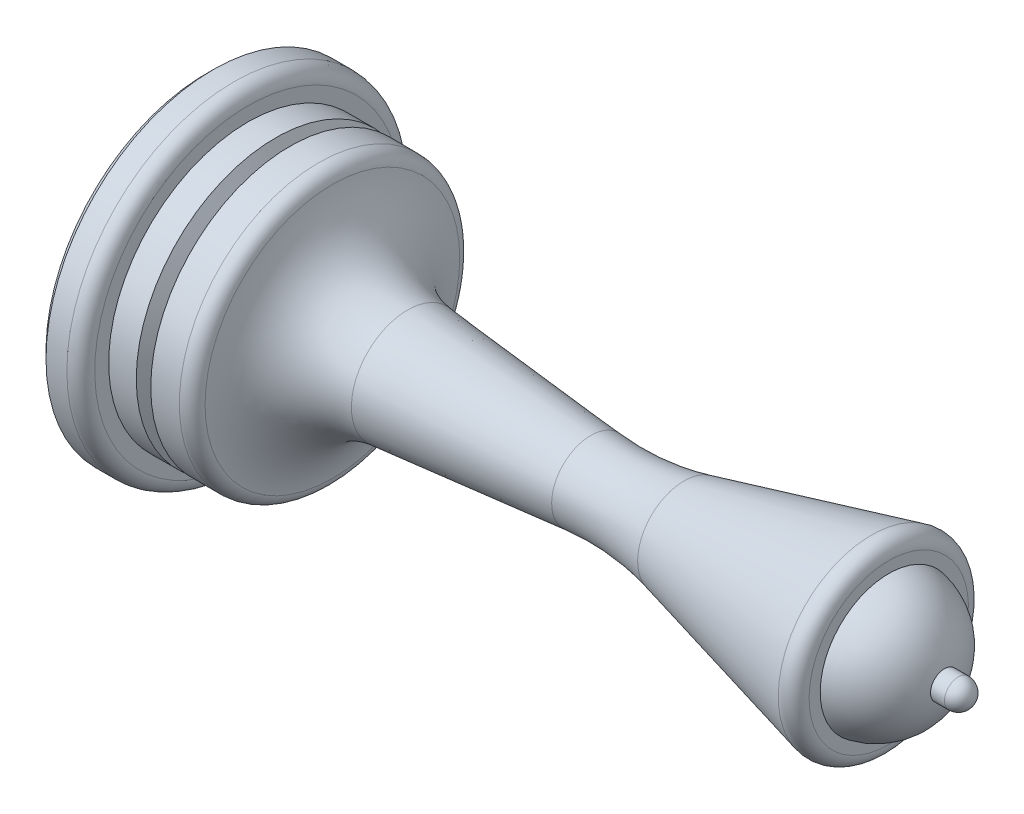
ISO-10303-21;
HEADER;
FILE_DESCRIPTION(('STEP AP214'),'2;1');
FILE_NAME('part.step','',(''),(''),'','','');
FILE_SCHEMA(('AUTOMOTIVE_DESIGN { 1 0 10303 214 1 1 1 1 }'));
ENDSEC;
DATA;
#1=APPLICATION_CONTEXT('core data for automotive mechanical design processes');
#2=APPLICATION_PROTOCOL_DEFINITION('international standard','automotive_design',2000,#1);
#3=PRODUCT_CONTEXT('',#1,'mechanical');
#4=PRODUCT('Part','Part','',(#3));
#5=PRODUCT_RELATED_PRODUCT_CATEGORY('part','',(#4));
#6=PRODUCT_DEFINITION_FORMATION('','',#4);
#7=PRODUCT_DEFINITION_CONTEXT('part definition',#1,'design');
#8=PRODUCT_DEFINITION('design','',#6,#7);
#9=PRODUCT_DEFINITION_SHAPE('','',#8);
#10=(LENGTH_UNIT() NAMED_UNIT(*) SI_UNIT(.MILLI.,.METRE.));
#11=(NAMED_UNIT(*) PLANE_ANGLE_UNIT() SI_UNIT($,.RADIAN.));
#12=(NAMED_UNIT(*) SI_UNIT($,.STERADIAN.) SOLID_ANGLE_UNIT());
#13=UNCERTAINTY_MEASURE_WITH_UNIT(LENGTH_MEASURE(1.E-05),#10,'distance_accuracy_value','');
#14=(GEOMETRIC_REPRESENTATION_CONTEXT(3) GLOBAL_UNCERTAINTY_ASSIGNED_CONTEXT((#13)) GLOBAL_UNIT_ASSIGNED_CONTEXT((#10,
#11,#12)) REPRESENTATION_CONTEXT('',''));
#15=CARTESIAN_POINT('',(0.,0.,0.));
#16=DIRECTION('',(0.,0.,1.));
#17=DIRECTION('',(1.,0.,0.));
#18=AXIS2_PLACEMENT_3D('',#15,#16,#17);
#19=CARTESIAN_POINT('',(0.,0.,0.));
#20=DIRECTION('',(-1.,0.,0.));
#21=DIRECTION('',(0.,-1.,0.));
#22=AXIS2_PLACEMENT_3D('',#19,#20,#21);
#23=CYLINDRICAL_SURFACE('',#22,10.);
#24=CARTESIAN_POINT('',(8.07179676972449,0.,0.));
#25=DIRECTION('',(-1.,0.,0.));
#26=DIRECTION('',(0.,-1.,0.));
#27=AXIS2_PLACEMENT_3D('',#24,#25,#26);
#28=CIRCLE('',#27,10.);
#29=CARTESIAN_POINT('',(8.07179676972449,-10.,0.));
#30=VERTEX_POINT('',#29);
#31=EDGE_CURVE('E65',#30,#30,#28,.T.);
#32=ORIENTED_EDGE('',*,*,#31,.T.);
#33=EDGE_LOOP('',(#32));
#34=FACE_BOUND('',#33,.T.);
#35=CARTESIAN_POINT('',(6.02056705055174,0.,0.));
#36=DIRECTION('',(-1.,0.,0.));
#37=DIRECTION('',(0.,0.,1.));
#38=AXIS2_PLACEMENT_3D('',#35,#36,#37);
#39=CIRCLE('',#38,10.);
#40=CARTESIAN_POINT('',(6.02056705055174,0.,10.));
#41=VERTEX_POINT('',#40);
#42=EDGE_CURVE('E89',#41,#41,#39,.T.);
#43=ORIENTED_EDGE('',*,*,#42,.F.);
#44=EDGE_LOOP('',(#43));
#45=FACE_BOUND('',#44,.T.);
#46=ADVANCED_FACE('F30',(#34,#45),#23,.T.);
#47=CARTESIAN_POINT('',(54.,0.,0.));
#48=DIRECTION('',(-1.,0.,0.));
#49=DIRECTION('',(0.,1.,0.));
#50=AXIS2_PLACEMENT_3D('',#47,#48,#49);
#51=SPHERICAL_SURFACE('',#50,1.);
#52=CARTESIAN_POINT('',(54.,0.,0.));
#53=DIRECTION('',(-1.,0.,0.));
#54=DIRECTION('',(0.,-1.,0.));
#55=AXIS2_PLACEMENT_3D('',#52,#53,#54);
#56=CIRCLE('',#55,1.);
#57=CARTESIAN_POINT('',(54.,-1.,0.));
#58=VERTEX_POINT('',#57);
#59=EDGE_CURVE('E41',#58,#58,#56,.T.);
#60=ORIENTED_EDGE('',*,*,#59,.F.);
#61=EDGE_LOOP('',(#60));
#62=FACE_BOUND('',#61,.T.);
#63=ADVANCED_FACE('F159',(#62),#51,.T.);
#64=CARTESIAN_POINT('',(0.,0.,0.));
#65=DIRECTION('',(-1.,0.,0.));
#66=DIRECTION('',(0.,-1.,0.));
#67=AXIS2_PLACEMENT_3D('',#64,#65,#66);
#68=CYLINDRICAL_SURFACE('',#67,1.);
#69=CARTESIAN_POINT('',(53.,0.,0.));
#70=DIRECTION('',(-1.,0.,0.));
#71=DIRECTION('',(0.,-1.,0.));
#72=AXIS2_PLACEMENT_3D('',#69,#70,#71);
#73=CIRCLE('',#72,1.);
#74=CARTESIAN_POINT('',(53.,-1.,0.));
#75=VERTEX_POINT('',#74);
#76=EDGE_CURVE('E45',#75,#75,#73,.T.);
#77=ORIENTED_EDGE('',*,*,#76,.F.);
#78=EDGE_LOOP('',(#77));
#79=FACE_BOUND('',#78,.T.);
#80=ORIENTED_EDGE('',*,*,#59,.T.);
#81=EDGE_LOOP('',(#80));
#82=FACE_BOUND('',#81,.T.);
#83=ADVANCED_FACE('F164',(#79,#82),#68,.T.);
#84=CARTESIAN_POINT('',(48.1010205144336,0.,0.));
#85=DIRECTION('',(-1.,0.,0.));
#86=DIRECTION('',(0.,1.,0.));
#87=AXIS2_PLACEMENT_3D('',#84,#85,#86);
#88=SPHERICAL_SURFACE('',#87,5.);
#89=CARTESIAN_POINT('',(49.,0.,0.));
#90=DIRECTION('',(-1.,0.,0.));
#91=DIRECTION('',(0.,-1.,0.));
#92=AXIS2_PLACEMENT_3D('',#89,#90,#91);
#93=CIRCLE('',#92,4.91851968426791);
#94=CARTESIAN_POINT('',(49.,-4.91851968426791,0.));
#95=VERTEX_POINT('',#94);
#96=EDGE_CURVE('E50',#95,#95,#93,.T.);
#97=ORIENTED_EDGE('',*,*,#96,.F.);
#98=EDGE_LOOP('',(#97));
#99=FACE_BOUND('',#98,.T.);
#100=ORIENTED_EDGE('',*,*,#76,.T.);
#101=EDGE_LOOP('',(#100));
#102=FACE_BOUND('',#101,.T.);
#103=ADVANCED_FACE('F185',(#99,#102),#88,.T.);
#104=CARTESIAN_POINT('',(49.,7.,0.));
#105=DIRECTION('',(-1.,0.,0.));
#106=DIRECTION('',(0.,-1.,0.));
#107=AXIS2_PLACEMENT_3D('',#104,#105,#106);
#108=PLANE('',#107);
#109=CARTESIAN_POINT('',(49.,0.,0.));
#110=DIRECTION('',(-1.,0.,0.));
#111=DIRECTION('',(0.,-1.,0.));
#112=AXIS2_PLACEMENT_3D('',#109,#110,#111);
#113=CIRCLE('',#112,5.71922359359559);
#114=CARTESIAN_POINT('',(49.,-5.71922359359559,0.));
#115=VERTEX_POINT('',#114);
#116=EDGE_CURVE('E10',#115,#115,#113,.F.);
#117=ORIENTED_EDGE('',*,*,#116,.T.);
#118=EDGE_LOOP('',(#117));
#119=FACE_BOUND('',#118,.T.);
#120=ORIENTED_EDGE('',*,*,#96,.T.);
#121=EDGE_LOOP('',(#120));
#122=FACE_BOUND('',#121,.T.);
#123=ADVANCED_FACE('F182',(#119,#122),#108,.F.);
#124=CARTESIAN_POINT('',(49.,0.,0.));
#125=DIRECTION('',(1.,0.,0.));
#126=DIRECTION('',(0.,1.,0.));
#127=AXIS2_PLACEMENT_3D('',#124,#125,#126);
#128=CONICAL_SURFACE('',#127,7.,0.244978663126864);
#129=CARTESIAN_POINT('',(47.7574643749637,0.,0.));
#130=DIRECTION('',(-1.,0.,0.));
#131=DIRECTION('',(0.,-1.,0.));
#132=AXIS2_PLACEMENT_3D('',#129,#130,#131);
#133=CIRCLE('',#132,6.68936609374092);
#134=CARTESIAN_POINT('',(47.7574643749637,-6.68936609374092,0.));
#135=VERTEX_POINT('',#134);
#136=EDGE_CURVE('E37',#135,#135,#133,.T.);
#137=ORIENTED_EDGE('',*,*,#136,.T.);
#138=EDGE_LOOP('',(#137));
#139=FACE_BOUND('',#138,.T.);
#140=CARTESIAN_POINT('',(34.2994782841861,0.,0.));
#141=DIRECTION('',(-1.,0.,0.));
#142=DIRECTION('',(0.,-1.,0.));
#143=AXIS2_PLACEMENT_3D('',#140,#141,#142);
#144=CIRCLE('',#143,3.32486957104653);
#145=CARTESIAN_POINT('',(34.2994782841861,-3.32486957104653,0.));
#146=VERTEX_POINT('',#145);
#147=EDGE_CURVE('E53',#146,#146,#144,.T.);
#148=ORIENTED_EDGE('',*,*,#147,.F.);
#149=EDGE_LOOP('',(#148));
#150=FACE_BOUND('',#149,.T.);
#151=ADVANCED_FACE('F178',(#139,#150),#128,.T.);
#152=CARTESIAN_POINT('',(29.4487657834594,0.,0.));
#153=DIRECTION('',(-1.,0.,0.));
#154=DIRECTION('',(0.,-1.,0.));
#155=AXIS2_PLACEMENT_3D('',#152,#153,#154);
#156=TOROIDAL_SURFACE('',#155,22.7277195739532,20.);
#157=CARTESIAN_POINT('',(27.6133277665205,0.,0.));
#158=DIRECTION('',(-1.,0.,0.));
#159=DIRECTION('',(0.,-1.,0.));
#160=AXIS2_PLACEMENT_3D('',#157,#158,#159);
#161=CIRCLE('',#160,2.81211847115);
#162=CARTESIAN_POINT('',(27.6133277665205,-2.81211847115,0.));
#163=VERTEX_POINT('',#162);
#164=EDGE_CURVE('E56',#163,#163,#161,.T.);
#165=ORIENTED_EDGE('',*,*,#164,.F.);
#166=EDGE_LOOP('',(#165));
#167=FACE_BOUND('',#166,.T.);
#168=ORIENTED_EDGE('',*,*,#147,.T.);
#169=EDGE_LOOP('',(#168));
#170=FACE_BOUND('',#169,.T.);
#171=ADVANCED_FACE('F174',(#167,#170),#156,.F.);
#172=CARTESIAN_POINT('',(27.6133277665205,0.,0.));
#173=DIRECTION('',(-1.,0.,0.));
#174=DIRECTION('',(0.,-1.,0.));
#175=AXIS2_PLACEMENT_3D('',#172,#173,#174);
#176=CONICAL_SURFACE('',#175,2.81211847115,0.0919012099312634);
#177=CARTESIAN_POINT('',(14.4493685949183,0.,0.));
#178=DIRECTION('',(-1.,0.,0.));
#179=DIRECTION('',(0.,-1.,0.));
#180=AXIS2_PLACEMENT_3D('',#177,#178,#179);
#181=CIRCLE('',#180,4.02531966915905);
#182=CARTESIAN_POINT('',(14.4493685949183,-4.02531966915905,0.));
#183=VERTEX_POINT('',#182);
#184=EDGE_CURVE('E59',#183,#183,#181,.T.);
#185=ORIENTED_EDGE('',*,*,#184,.F.);
#186=EDGE_LOOP('',(#185));
#187=FACE_BOUND('',#186,.T.);
#188=ORIENTED_EDGE('',*,*,#164,.T.);
#189=EDGE_LOOP('',(#188));
#190=FACE_BOUND('',#189,.T.);
#191=ADVANCED_FACE('F170',(#187,#190),#176,.T.);
#192=CARTESIAN_POINT('',(15.,0.,0.));
#193=DIRECTION('',(-1.,0.,0.));
#194=DIRECTION('',(0.,-1.,0.));
#195=AXIS2_PLACEMENT_3D('',#192,#193,#194);
#196=TOROIDAL_SURFACE('',#195,10.,6.);
#197=CARTESIAN_POINT('',(9.06154008833528,0.,0.));
#198=DIRECTION('',(-1.,0.,0.));
#199=DIRECTION('',(0.,-1.,0.));
#200=AXIS2_PLACEMENT_3D('',#197,#198,#199);
#201=CIRCLE('',#200,9.14285714285714);
#202=CARTESIAN_POINT('',(9.06154008833528,-9.14285714285714,0.));
#203=VERTEX_POINT('',#202);
#204=EDGE_CURVE('E62',#203,#203,#201,.T.);
#205=ORIENTED_EDGE('',*,*,#204,.F.);
#206=EDGE_LOOP('',(#205));
#207=FACE_BOUND('',#206,.T.);
#208=ORIENTED_EDGE('',*,*,#184,.T.);
#209=EDGE_LOOP('',(#208));
#210=FACE_BOUND('',#209,.T.);
#211=ADVANCED_FACE('F155',(#207,#210),#196,.F.);
#212=CARTESIAN_POINT('',(8.07179676972449,0.,0.));
#213=DIRECTION('',(-1.,0.,0.));
#214=DIRECTION('',(0.,-1.,0.));
#215=AXIS2_PLACEMENT_3D('',#212,#213,#214);
#216=TOROIDAL_SURFACE('',#215,9.,1.);
#217=ORIENTED_EDGE('',*,*,#31,.F.);
#218=EDGE_LOOP('',(#217));
#219=FACE_BOUND('',#218,.T.);
#220=ORIENTED_EDGE('',*,*,#204,.T.);
#221=EDGE_LOOP('',(#220));
#222=FACE_BOUND('',#221,.T.);
#223=ADVANCED_FACE('F146',(#219,#222),#216,.T.);
#224=CARTESIAN_POINT('',(4.97943294944826,0.,0.));
#225=DIRECTION('',(-1.,0.,0.));
#226=DIRECTION('',(0.,0.,1.));
#227=AXIS2_PLACEMENT_3D('',#224,#225,#226);
#228=CONICAL_SURFACE('',#227,10.,1.09083078249646);
#229=CARTESIAN_POINT('',(5.5,0.,0.));
#230=DIRECTION('',(-1.,0.,0.));
#231=DIRECTION('',(0.,0.,1.));
#232=AXIS2_PLACEMENT_3D('',#229,#230,#231);
#233=CIRCLE('',#232,9.);
#234=CARTESIAN_POINT('',(5.5,0.,9.));
#235=VERTEX_POINT('',#234);
#236=EDGE_CURVE('E86',#235,#235,#233,.T.);
#237=ORIENTED_EDGE('',*,*,#236,.T.);
#238=EDGE_LOOP('',(#237));
#239=FACE_BOUND('',#238,.T.);
#240=CARTESIAN_POINT('',(4.97943294944826,0.,0.));
#241=DIRECTION('',(-1.,0.,0.));
#242=DIRECTION('',(0.,0.,1.));
#243=AXIS2_PLACEMENT_3D('',#240,#241,#242);
#244=CIRCLE('',#243,10.);
#245=CARTESIAN_POINT('',(4.97943294944826,0.,10.));
#246=VERTEX_POINT('',#245);
#247=EDGE_CURVE('E83',#246,#246,#244,.T.);
#248=ORIENTED_EDGE('',*,*,#247,.F.);
#249=EDGE_LOOP('',(#248));
#250=FACE_BOUND('',#249,.T.);
#251=ADVANCED_FACE('F144',(#239,#250),#228,.T.);
#252=CARTESIAN_POINT('',(5.5,0.,0.));
#253=DIRECTION('',(1.,0.,0.));
#254=DIRECTION('',(0.,0.,-1.));
#255=AXIS2_PLACEMENT_3D('',#252,#253,#254);
#256=CONICAL_SURFACE('',#255,9.,1.09083078249646);
#257=ORIENTED_EDGE('',*,*,#42,.T.);
#258=EDGE_LOOP('',(#257));
#259=FACE_BOUND('',#258,.T.);
#260=ORIENTED_EDGE('',*,*,#236,.F.);
#261=EDGE_LOOP('',(#260));
#262=FACE_BOUND('',#261,.T.);
#263=ADVANCED_FACE('F112',(#259,#262),#256,.T.);
#264=CARTESIAN_POINT('',(0.,0.,0.));
#265=DIRECTION('',(1.,0.,0.));
#266=DIRECTION('',(0.,1.,0.));
#267=AXIS2_PLACEMENT_3D('',#264,#265,#266);
#268=PLANE('',#267);
#269=CARTESIAN_POINT('',(0.,0.,0.));
#270=DIRECTION('',(-1.,0.,0.));
#271=DIRECTION('',(0.,-1.,0.));
#272=AXIS2_PLACEMENT_3D('',#269,#270,#271);
#273=CIRCLE('',#272,6.);
#274=CARTESIAN_POINT('',(0.,-6.,0.));
#275=VERTEX_POINT('',#274);
#276=EDGE_CURVE('E93',#275,#275,#273,.T.);
#277=ORIENTED_EDGE('',*,*,#276,.F.);
#278=EDGE_LOOP('',(#277));
#279=FACE_BOUND('',#278,.T.);
#280=CARTESIAN_POINT('',(0.,0.,0.));
#281=DIRECTION('',(-1.,0.,0.));
#282=DIRECTION('',(0.,-1.,0.));
#283=AXIS2_PLACEMENT_3D('',#280,#281,#282);
#284=CIRCLE('',#283,11.5);
#285=CARTESIAN_POINT('',(0.,-11.5,0.));
#286=VERTEX_POINT('',#285);
#287=EDGE_CURVE('E80',#286,#286,#284,.T.);
#288=ORIENTED_EDGE('',*,*,#287,.T.);
#289=EDGE_LOOP('',(#288));
#290=FACE_BOUND('',#289,.T.);
#291=ADVANCED_FACE('F108',(#279,#290),#268,.F.);
#292=CARTESIAN_POINT('',(0.5,0.,0.));
#293=DIRECTION('',(1.,0.,0.));
#294=DIRECTION('',(0.,1.,0.));
#295=AXIS2_PLACEMENT_3D('',#292,#293,#294);
#296=CONICAL_SURFACE('',#295,12.,0.785398163397449);
#297=ORIENTED_EDGE('',*,*,#287,.F.);
#298=EDGE_LOOP('',(#297));
#299=FACE_BOUND('',#298,.T.);
#300=CARTESIAN_POINT('',(0.5,0.,0.));
#301=DIRECTION('',(-1.,0.,0.));
#302=DIRECTION('',(0.,-1.,0.));
#303=AXIS2_PLACEMENT_3D('',#300,#301,#302);
#304=CIRCLE('',#303,12.);
#305=CARTESIAN_POINT('',(0.5,-12.,0.));
#306=VERTEX_POINT('',#305);
#307=EDGE_CURVE('E77',#306,#306,#304,.T.);
#308=ORIENTED_EDGE('',*,*,#307,.T.);
#309=EDGE_LOOP('',(#308));
#310=FACE_BOUND('',#309,.T.);
#311=ADVANCED_FACE('F111',(#299,#310),#296,.T.);
#312=CARTESIAN_POINT('',(0.,0.,0.));
#313=DIRECTION('',(-1.,0.,0.));
#314=DIRECTION('',(0.,-1.,0.));
#315=AXIS2_PLACEMENT_3D('',#312,#313,#314);
#316=CYLINDRICAL_SURFACE('',#315,12.);
#317=ORIENTED_EDGE('',*,*,#307,.F.);
#318=EDGE_LOOP('',(#317));
#319=FACE_BOUND('',#318,.T.);
#320=CARTESIAN_POINT('',(2.,0.,0.));
#321=DIRECTION('',(-1.,0.,0.));
#322=DIRECTION('',(0.,-1.,0.));
#323=AXIS2_PLACEMENT_3D('',#320,#321,#322);
#324=CIRCLE('',#323,12.);
#325=CARTESIAN_POINT('',(2.,-12.,0.));
#326=VERTEX_POINT('',#325);
#327=EDGE_CURVE('E74',#326,#326,#324,.T.);
#328=ORIENTED_EDGE('',*,*,#327,.T.);
#329=EDGE_LOOP('',(#328));
#330=FACE_BOUND('',#329,.T.);
#331=ADVANCED_FACE('F118',(#319,#330),#316,.T.);
#332=CARTESIAN_POINT('',(2.,0.,0.));
#333=DIRECTION('',(-1.,0.,0.));
#334=DIRECTION('',(0.,-1.,0.));
#335=AXIS2_PLACEMENT_3D('',#332,#333,#334);
#336=TOROIDAL_SURFACE('',#335,11.,1.);
#337=ORIENTED_EDGE('',*,*,#327,.F.);
#338=EDGE_LOOP('',(#337));
#339=FACE_BOUND('',#338,.T.);
#340=CARTESIAN_POINT('',(3.,0.,0.));
#341=DIRECTION('',(-1.,0.,0.));
#342=DIRECTION('',(0.,-1.,0.));
#343=AXIS2_PLACEMENT_3D('',#340,#341,#342);
#344=CIRCLE('',#343,11.);
#345=CARTESIAN_POINT('',(3.,-11.,0.));
#346=VERTEX_POINT('',#345);
#347=EDGE_CURVE('E71',#346,#346,#344,.T.);
#348=ORIENTED_EDGE('',*,*,#347,.T.);
#349=EDGE_LOOP('',(#348));
#350=FACE_BOUND('',#349,.T.);
#351=ADVANCED_FACE('F124',(#339,#350),#336,.T.);
#352=CARTESIAN_POINT('',(3.,11.,0.));
#353=DIRECTION('',(-1.,0.,0.));
#354=DIRECTION('',(0.,-1.,0.));
#355=AXIS2_PLACEMENT_3D('',#352,#353,#354);
#356=PLANE('',#355);
#357=ORIENTED_EDGE('',*,*,#347,.F.);
#358=EDGE_LOOP('',(#357));
#359=FACE_BOUND('',#358,.T.);
#360=CARTESIAN_POINT('',(3.,0.,0.));
#361=DIRECTION('',(-1.,0.,0.));
#362=DIRECTION('',(0.,-1.,0.));
#363=AXIS2_PLACEMENT_3D('',#360,#361,#362);
#364=CIRCLE('',#363,10.);
#365=CARTESIAN_POINT('',(3.,-10.,0.));
#366=VERTEX_POINT('',#365);
#367=EDGE_CURVE('E68',#366,#366,#364,.T.);
#368=ORIENTED_EDGE('',*,*,#367,.T.);
#369=EDGE_LOOP('',(#368));
#370=FACE_BOUND('',#369,.T.);
#371=ADVANCED_FACE('F130',(#359,#370),#356,.F.);
#372=ORIENTED_EDGE('',*,*,#367,.F.);
#373=EDGE_LOOP('',(#372));
#374=FACE_BOUND('',#373,.T.);
#375=ORIENTED_EDGE('',*,*,#247,.T.);
#376=EDGE_LOOP('',(#375));
#377=FACE_BOUND('',#376,.T.);
#378=ADVANCED_FACE('F104',(#374,#377),#23,.T.);
#379=CARTESIAN_POINT('',(5.,0.,0.));
#380=DIRECTION('',(-1.,0.,0.));
#381=DIRECTION('',(0.,-1.,0.));
#382=AXIS2_PLACEMENT_3D('',#379,#380,#381);
#383=CYLINDRICAL_SURFACE('',#382,6.);
#384=CARTESIAN_POINT('',(5.,0.,0.));
#385=DIRECTION('',(-1.,0.,0.));
#386=DIRECTION('',(0.,-1.,0.));
#387=AXIS2_PLACEMENT_3D('',#384,#385,#386);
#388=CIRCLE('',#387,6.);
#389=CARTESIAN_POINT('',(5.,-6.,0.));
#390=VERTEX_POINT('',#389);
#391=EDGE_CURVE('E92',#390,#390,#388,.T.);
#392=ORIENTED_EDGE('',*,*,#391,.F.);
#393=EDGE_LOOP('',(#392));
#394=FACE_BOUND('',#393,.T.);
#395=ORIENTED_EDGE('',*,*,#276,.T.);
#396=EDGE_LOOP('',(#395));
#397=FACE_BOUND('',#396,.T.);
#398=ADVANCED_FACE('F101',(#394,#397),#383,.F.);
#399=CARTESIAN_POINT('',(5.,0.,0.));
#400=DIRECTION('',(-1.,0.,0.));
#401=DIRECTION('',(0.,-1.,0.));
#402=AXIS2_PLACEMENT_3D('',#399,#400,#401);
#403=PLANE('',#402);
#404=ORIENTED_EDGE('',*,*,#391,.T.);
#405=EDGE_LOOP('',(#404));
#406=FACE_BOUND('',#405,.T.);
#407=ADVANCED_FACE('F99',(#406),#403,.T.);
#408=CARTESIAN_POINT('',(48.,0.,0.));
#409=DIRECTION('',(-1.,0.,0.));
#410=DIRECTION('',(0.,-1.,0.));
#411=AXIS2_PLACEMENT_3D('',#408,#409,#410);
#412=TOROIDAL_SURFACE('',#411,5.71922359359559,1.);
#413=ORIENTED_EDGE('',*,*,#116,.F.);
#414=EDGE_LOOP('',(#413));
#415=FACE_BOUND('',#414,.T.);
#416=ORIENTED_EDGE('',*,*,#136,.F.);
#417=EDGE_LOOP('',(#416));
#418=FACE_BOUND('',#417,.T.);
#419=ADVANCED_FACE('F32',(#415,#418),#412,.T.);
#420=CLOSED_SHELL('',(#46,#63,#83,#103,#123,#151,#171,#191,#211,#223,#251,#263,#291,#311,#331,
#351,#371,#378,#398,#407,#419));
#421=MANIFOLD_SOLID_BREP('B2',#420);
#422=ADVANCED_BREP_SHAPE_REPRESENTATION('',(#18,#421),#14);
#423=SHAPE_DEFINITION_REPRESENTATION(#9,#422);
ENDSEC;
END-ISO-10303-21;
